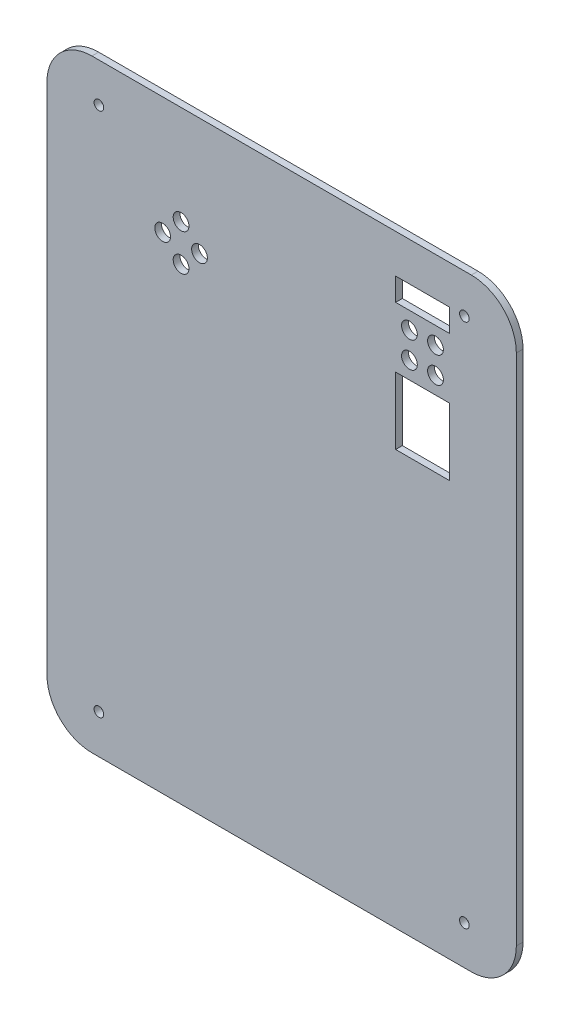
ISO-10303-21;
HEADER;
FILE_DESCRIPTION(('STEP AP214'),'2;1');
FILE_NAME('part.step','',(''),(''),'','','');
FILE_SCHEMA(('AUTOMOTIVE_DESIGN { 1 0 10303 214 1 1 1 1 }'));
ENDSEC;
DATA;
#1=APPLICATION_CONTEXT('core data for automotive mechanical design processes');
#2=APPLICATION_PROTOCOL_DEFINITION('international standard','automotive_design',2000,#1);
#3=PRODUCT_CONTEXT('',#1,'mechanical');
#4=PRODUCT('Part','Part','',(#3));
#5=PRODUCT_RELATED_PRODUCT_CATEGORY('part','',(#4));
#6=PRODUCT_DEFINITION_FORMATION('','',#4);
#7=PRODUCT_DEFINITION_CONTEXT('part definition',#1,'design');
#8=PRODUCT_DEFINITION('design','',#6,#7);
#9=PRODUCT_DEFINITION_SHAPE('','',#8);
#10=(LENGTH_UNIT() NAMED_UNIT(*) SI_UNIT(.MILLI.,.METRE.));
#11=(NAMED_UNIT(*) PLANE_ANGLE_UNIT() SI_UNIT($,.RADIAN.));
#12=(NAMED_UNIT(*) SI_UNIT($,.STERADIAN.) SOLID_ANGLE_UNIT());
#13=UNCERTAINTY_MEASURE_WITH_UNIT(LENGTH_MEASURE(1.E-05),#10,'distance_accuracy_value','');
#14=(GEOMETRIC_REPRESENTATION_CONTEXT(3) GLOBAL_UNCERTAINTY_ASSIGNED_CONTEXT((#13)) GLOBAL_UNIT_ASSIGNED_CONTEXT((#10,
#11,#12)) REPRESENTATION_CONTEXT('',''));
#15=CARTESIAN_POINT('',(0.,0.,0.));
#16=DIRECTION('',(0.,0.,1.));
#17=DIRECTION('',(1.,0.,0.));
#18=AXIS2_PLACEMENT_3D('',#15,#16,#17);
#19=CARTESIAN_POINT('',(-71.8566,-97.2566,0.));
#20=DIRECTION('',(0.,0.,-1.));
#21=DIRECTION('',(-1.,0.,0.));
#22=AXIS2_PLACEMENT_3D('',#19,#20,#21);
#23=PLANE('',#22);
#24=CARTESIAN_POINT('',(-71.8566,-97.2566,0.));
#25=DIRECTION('',(0.,0.,1.));
#26=DIRECTION('',(-1.,0.,0.));
#27=AXIS2_PLACEMENT_3D('',#24,#25,#26);
#28=CIRCLE('',#27,17.0434);
#29=CARTESIAN_POINT('',(-88.9,-97.2566,0.));
#30=VERTEX_POINT('',#29);
#31=CARTESIAN_POINT('',(-71.8566,-114.3,0.));
#32=VERTEX_POINT('',#31);
#33=EDGE_CURVE('E306',#30,#32,#28,.T.);
#34=ORIENTED_EDGE('',*,*,#33,.F.);
#35=DIRECTION('',(0.,-1.,0.));
#36=VECTOR('',#35,1.);
#37=CARTESIAN_POINT('',(-88.9,-97.2566,0.));
#38=LINE('',#37,#36);
#39=CARTESIAN_POINT('',(-88.9,97.2566,0.));
#40=VERTEX_POINT('',#39);
#41=EDGE_CURVE('E315',#40,#30,#38,.T.);
#42=ORIENTED_EDGE('',*,*,#41,.F.);
#43=CARTESIAN_POINT('',(-71.8566,97.2566,0.));
#44=DIRECTION('',(0.,0.,1.));
#45=DIRECTION('',(-1.,0.,0.));
#46=AXIS2_PLACEMENT_3D('',#43,#44,#45);
#47=CIRCLE('',#46,17.0434);
#48=CARTESIAN_POINT('',(-71.8566,114.3,0.));
#49=VERTEX_POINT('',#48);
#50=EDGE_CURVE('E355',#49,#40,#47,.T.);
#51=ORIENTED_EDGE('',*,*,#50,.F.);
#52=DIRECTION('',(-1.,0.,0.));
#53=VECTOR('',#52,1.);
#54=CARTESIAN_POINT('',(71.8566,114.3,0.));
#55=LINE('',#54,#53);
#56=CARTESIAN_POINT('',(71.8566,114.3,0.));
#57=VERTEX_POINT('',#56);
#58=EDGE_CURVE('E352',#57,#49,#55,.T.);
#59=ORIENTED_EDGE('',*,*,#58,.F.);
#60=CARTESIAN_POINT('',(71.8566,97.2566,0.));
#61=DIRECTION('',(0.,0.,1.));
#62=DIRECTION('',(1.,0.,0.));
#63=AXIS2_PLACEMENT_3D('',#60,#61,#62);
#64=CIRCLE('',#63,17.0434);
#65=CARTESIAN_POINT('',(88.9,97.2566,0.));
#66=VERTEX_POINT('',#65);
#67=EDGE_CURVE('E349',#66,#57,#64,.T.);
#68=ORIENTED_EDGE('',*,*,#67,.F.);
#69=DIRECTION('',(0.,1.,0.));
#70=VECTOR('',#69,1.);
#71=CARTESIAN_POINT('',(88.9,-97.2566,0.));
#72=LINE('',#71,#70);
#73=CARTESIAN_POINT('',(88.9,-97.2566,0.));
#74=VERTEX_POINT('',#73);
#75=EDGE_CURVE('E346',#74,#66,#72,.T.);
#76=ORIENTED_EDGE('',*,*,#75,.F.);
#77=CARTESIAN_POINT('',(71.8566,-97.2566,0.));
#78=DIRECTION('',(0.,0.,1.));
#79=DIRECTION('',(-1.,0.,0.));
#80=AXIS2_PLACEMENT_3D('',#77,#78,#79);
#81=CIRCLE('',#80,17.0434);
#82=CARTESIAN_POINT('',(71.8566,-114.3,0.));
#83=VERTEX_POINT('',#82);
#84=EDGE_CURVE('E343',#83,#74,#81,.T.);
#85=ORIENTED_EDGE('',*,*,#84,.F.);
#86=DIRECTION('',(1.,0.,0.));
#87=VECTOR('',#86,1.);
#88=CARTESIAN_POINT('',(71.8566,-114.3,0.));
#89=LINE('',#88,#87);
#90=EDGE_CURVE('E340',#32,#83,#89,.T.);
#91=ORIENTED_EDGE('',*,*,#90,.F.);
#92=EDGE_LOOP('',(#34,#42,#51,#59,#68,#76,#85,#91));
#93=FACE_BOUND('',#92,.T.);
#94=CARTESIAN_POINT('',(58.279140866588,84.504640866588,0.));
#95=DIRECTION('',(0.,0.,1.));
#96=DIRECTION('',(1.,0.,0.));
#97=AXIS2_PLACEMENT_3D('',#94,#95,#96);
#98=CIRCLE('',#97,2.9845);
#99=CARTESIAN_POINT('',(61.263640866588,84.504640866588,0.));
#100=VERTEX_POINT('',#99);
#101=EDGE_CURVE('E302',#100,#100,#98,.T.);
#102=ORIENTED_EDGE('',*,*,#101,.T.);
#103=EDGE_LOOP('',(#102));
#104=FACE_BOUND('',#103,.T.);
#105=DIRECTION('',(0.,-1.,0.));
#106=VECTOR('',#105,1.);
#107=CARTESIAN_POINT('',(43.18,42.7355,0.));
#108=LINE('',#107,#106);
#109=CARTESIAN_POINT('',(43.18,68.1355,0.));
#110=VERTEX_POINT('',#109);
#111=CARTESIAN_POINT('',(43.18,42.7355,0.));
#112=VERTEX_POINT('',#111);
#113=EDGE_CURVE('E161',#110,#112,#108,.T.);
#114=ORIENTED_EDGE('',*,*,#113,.T.);
#115=DIRECTION('',(1.,0.,0.));
#116=VECTOR('',#115,1.);
#117=CARTESIAN_POINT('',(63.5,42.7355,0.));
#118=LINE('',#117,#116);
#119=CARTESIAN_POINT('',(63.5,42.7355,0.));
#120=VERTEX_POINT('',#119);
#121=EDGE_CURVE('E201',#112,#120,#118,.T.);
#122=ORIENTED_EDGE('',*,*,#121,.T.);
#123=DIRECTION('',(0.,1.,0.));
#124=VECTOR('',#123,1.);
#125=CARTESIAN_POINT('',(63.5,68.1355,0.));
#126=LINE('',#125,#124);
#127=CARTESIAN_POINT('',(63.5,68.1355,0.));
#128=VERTEX_POINT('',#127);
#129=EDGE_CURVE('E196',#120,#128,#126,.T.);
#130=ORIENTED_EDGE('',*,*,#129,.T.);
#131=DIRECTION('',(-1.,0.,0.));
#132=VECTOR('',#131,1.);
#133=CARTESIAN_POINT('',(43.18,68.1355,0.));
#134=LINE('',#133,#132);
#135=EDGE_CURVE('E193',#128,#110,#134,.T.);
#136=ORIENTED_EDGE('',*,*,#135,.T.);
#137=EDGE_LOOP('',(#114,#122,#130,#136));
#138=FACE_BOUND('',#137,.T.);
#139=CARTESIAN_POINT('',(-38.1,76.835,0.));
#140=DIRECTION('',(0.,0.,1.));
#141=DIRECTION('',(1.,0.,0.));
#142=AXIS2_PLACEMENT_3D('',#139,#140,#141);
#143=CIRCLE('',#142,2.9845);
#144=CARTESIAN_POINT('',(-35.1155,76.835,0.));
#145=VERTEX_POINT('',#144);
#146=EDGE_CURVE('E258',#145,#145,#143,.T.);
#147=ORIENTED_EDGE('',*,*,#146,.T.);
#148=EDGE_LOOP('',(#147));
#149=FACE_BOUND('',#148,.T.);
#150=CARTESIAN_POINT('',(48.400859133412,84.504640866588,0.));
#151=DIRECTION('',(0.,0.,1.));
#152=DIRECTION('',(1.,0.,0.));
#153=AXIS2_PLACEMENT_3D('',#150,#151,#152);
#154=CIRCLE('',#153,2.9845);
#155=CARTESIAN_POINT('',(51.385359133412,84.504640866588,0.));
#156=VERTEX_POINT('',#155);
#157=EDGE_CURVE('E275',#156,#156,#154,.T.);
#158=ORIENTED_EDGE('',*,*,#157,.T.);
#159=EDGE_LOOP('',(#158));
#160=FACE_BOUND('',#159,.T.);
#161=CARTESIAN_POINT('',(48.400859133412,74.626359133412,0.));
#162=DIRECTION('',(0.,0.,1.));
#163=DIRECTION('',(1.,0.,0.));
#164=AXIS2_PLACEMENT_3D('',#161,#162,#163);
#165=CIRCLE('',#164,2.9845);
#166=CARTESIAN_POINT('',(51.385359133412,74.626359133412,0.));
#167=VERTEX_POINT('',#166);
#168=EDGE_CURVE('E274',#167,#167,#165,.T.);
#169=ORIENTED_EDGE('',*,*,#168,.T.);
#170=EDGE_LOOP('',(#169));
#171=FACE_BOUND('',#170,.T.);
#172=CARTESIAN_POINT('',(58.279140866588,74.626359133412,0.));
#173=DIRECTION('',(0.,0.,1.));
#174=DIRECTION('',(1.,0.,0.));
#175=AXIS2_PLACEMENT_3D('',#172,#173,#174);
#176=CIRCLE('',#175,2.9845);
#177=CARTESIAN_POINT('',(61.263640866588,74.626359133412,0.));
#178=VERTEX_POINT('',#177);
#179=EDGE_CURVE('E291',#178,#178,#176,.T.);
#180=ORIENTED_EDGE('',*,*,#179,.T.);
#181=EDGE_LOOP('',(#180));
#182=FACE_BOUND('',#181,.T.);
#183=DIRECTION('',(0.,-1.,0.));
#184=VECTOR('',#183,1.);
#185=CARTESIAN_POINT('',(43.18,99.6315,0.));
#186=LINE('',#185,#184);
#187=CARTESIAN_POINT('',(43.18,99.6315,0.));
#188=VERTEX_POINT('',#187);
#189=CARTESIAN_POINT('',(43.18,90.9955,0.));
#190=VERTEX_POINT('',#189);
#191=EDGE_CURVE('E230',#188,#190,#186,.T.);
#192=ORIENTED_EDGE('',*,*,#191,.T.);
#193=DIRECTION('',(1.,0.,0.));
#194=VECTOR('',#193,1.);
#195=CARTESIAN_POINT('',(43.18,90.9955,0.));
#196=LINE('',#195,#194);
#197=CARTESIAN_POINT('',(63.5,90.9955,0.));
#198=VERTEX_POINT('',#197);
#199=EDGE_CURVE('E247',#190,#198,#196,.T.);
#200=ORIENTED_EDGE('',*,*,#199,.T.);
#201=DIRECTION('',(0.,1.,0.));
#202=VECTOR('',#201,1.);
#203=CARTESIAN_POINT('',(63.5,90.9955,0.));
#204=LINE('',#203,#202);
#205=CARTESIAN_POINT('',(63.5,99.6315,0.));
#206=VERTEX_POINT('',#205);
#207=EDGE_CURVE('E243',#198,#206,#204,.T.);
#208=ORIENTED_EDGE('',*,*,#207,.T.);
#209=DIRECTION('',(-1.,0.,0.));
#210=VECTOR('',#209,1.);
#211=CARTESIAN_POINT('',(63.5,99.6315,0.));
#212=LINE('',#211,#210);
#213=EDGE_CURVE('E219',#206,#188,#212,.T.);
#214=ORIENTED_EDGE('',*,*,#213,.T.);
#215=EDGE_LOOP('',(#192,#200,#208,#214));
#216=FACE_BOUND('',#215,.T.);
#217=CARTESIAN_POINT('',(-45.085,69.85,0.));
#218=DIRECTION('',(0.,0.,1.));
#219=DIRECTION('',(1.,0.,0.));
#220=AXIS2_PLACEMENT_3D('',#217,#218,#219);
#221=CIRCLE('',#220,2.9845);
#222=CARTESIAN_POINT('',(-42.1005,69.85,0.));
#223=VERTEX_POINT('',#222);
#224=EDGE_CURVE('E212',#223,#223,#221,.T.);
#225=ORIENTED_EDGE('',*,*,#224,.T.);
#226=EDGE_LOOP('',(#225));
#227=FACE_BOUND('',#226,.T.);
#228=CARTESIAN_POINT('',(-38.1,62.865,0.));
#229=DIRECTION('',(0.,0.,1.));
#230=DIRECTION('',(1.,0.,0.));
#231=AXIS2_PLACEMENT_3D('',#228,#229,#230);
#232=CIRCLE('',#231,2.98450000000001);
#233=CARTESIAN_POINT('',(-35.1155,62.865,0.));
#234=VERTEX_POINT('',#233);
#235=EDGE_CURVE('E211',#234,#234,#232,.T.);
#236=ORIENTED_EDGE('',*,*,#235,.T.);
#237=EDGE_LOOP('',(#236));
#238=FACE_BOUND('',#237,.T.);
#239=CARTESIAN_POINT('',(-31.115,69.85,0.));
#240=DIRECTION('',(0.,0.,1.));
#241=DIRECTION('',(1.,0.,0.));
#242=AXIS2_PLACEMENT_3D('',#239,#240,#241);
#243=CIRCLE('',#242,2.9845);
#244=CARTESIAN_POINT('',(-28.1305,69.85,0.));
#245=VERTEX_POINT('',#244);
#246=EDGE_CURVE('E259',#245,#245,#243,.T.);
#247=ORIENTED_EDGE('',*,*,#246,.T.);
#248=EDGE_LOOP('',(#247));
#249=FACE_BOUND('',#248,.T.);
#250=CARTESIAN_POINT('',(69.219129999995,99.5086149999996,0.));
#251=DIRECTION('',(0.,0.,1.));
#252=DIRECTION('',(1.,0.,0.));
#253=AXIS2_PLACEMENT_3D('',#250,#251,#252);
#254=CIRCLE('',#253,1.82879999999999);
#255=CARTESIAN_POINT('',(71.047929999995,99.5086149999996,0.));
#256=VERTEX_POINT('',#255);
#257=EDGE_CURVE('E167',#256,#256,#254,.T.);
#258=ORIENTED_EDGE('',*,*,#257,.T.);
#259=EDGE_LOOP('',(#258));
#260=FACE_BOUND('',#259,.T.);
#261=CARTESIAN_POINT('',(-69.2191299999949,-99.5086149999996,0.));
#262=DIRECTION('',(0.,0.,1.));
#263=DIRECTION('',(1.,0.,0.));
#264=AXIS2_PLACEMENT_3D('',#261,#262,#263);
#265=CIRCLE('',#264,1.82879999999999);
#266=CARTESIAN_POINT('',(-67.390329999995,-99.5086149999996,0.));
#267=VERTEX_POINT('',#266);
#268=EDGE_CURVE('E549',#267,#267,#265,.T.);
#269=ORIENTED_EDGE('',*,*,#268,.T.);
#270=EDGE_LOOP('',(#269));
#271=FACE_BOUND('',#270,.T.);
#272=CARTESIAN_POINT('',(-69.21913,99.508615,0.));
#273=DIRECTION('',(0.,0.,1.));
#274=DIRECTION('',(1.,0.,0.));
#275=AXIS2_PLACEMENT_3D('',#272,#273,#274);
#276=CIRCLE('',#275,1.82879999999999);
#277=CARTESIAN_POINT('',(-67.39033,99.508615,0.));
#278=VERTEX_POINT('',#277);
#279=EDGE_CURVE('E541',#278,#278,#276,.T.);
#280=ORIENTED_EDGE('',*,*,#279,.T.);
#281=EDGE_LOOP('',(#280));
#282=FACE_BOUND('',#281,.T.);
#283=CARTESIAN_POINT('',(69.219129999995,-99.5086149999996,0.));
#284=DIRECTION('',(0.,0.,1.));
#285=DIRECTION('',(1.,0.,0.));
#286=AXIS2_PLACEMENT_3D('',#283,#284,#285);
#287=CIRCLE('',#286,1.82879999999999);
#288=CARTESIAN_POINT('',(71.047929999995,-99.5086149999996,0.));
#289=VERTEX_POINT('',#288);
#290=EDGE_CURVE('E528',#289,#289,#287,.T.);
#291=ORIENTED_EDGE('',*,*,#290,.T.);
#292=EDGE_LOOP('',(#291));
#293=FACE_BOUND('',#292,.T.);
#294=ADVANCED_FACE('F45',(#93,#104,#138,#149,#160,#171,#182,#216,#227,#238,#249,#260,#271,#282,
#293),#23,.T.);
#295=CARTESIAN_POINT('',(-71.8566,-97.2566,2.54));
#296=DIRECTION('',(0.,0.,-1.));
#297=DIRECTION('',(-1.,0.,0.));
#298=AXIS2_PLACEMENT_3D('',#295,#296,#297);
#299=PLANE('',#298);
#300=CARTESIAN_POINT('',(69.219129999995,-99.5086149999996,2.54));
#301=DIRECTION('',(0.,0.,1.));
#302=DIRECTION('',(1.,0.,0.));
#303=AXIS2_PLACEMENT_3D('',#300,#301,#302);
#304=CIRCLE('',#303,1.82879999999999);
#305=CARTESIAN_POINT('',(71.047929999995,-99.5086149999996,2.54));
#306=VERTEX_POINT('',#305);
#307=EDGE_CURVE('E531',#306,#306,#304,.T.);
#308=ORIENTED_EDGE('',*,*,#307,.F.);
#309=EDGE_LOOP('',(#308));
#310=FACE_BOUND('',#309,.T.);
#311=CARTESIAN_POINT('',(-69.21913,99.508615,2.54));
#312=DIRECTION('',(0.,0.,1.));
#313=DIRECTION('',(1.,0.,0.));
#314=AXIS2_PLACEMENT_3D('',#311,#312,#313);
#315=CIRCLE('',#314,1.82879999999999);
#316=CARTESIAN_POINT('',(-67.39033,99.508615,2.54));
#317=VERTEX_POINT('',#316);
#318=EDGE_CURVE('E535',#317,#317,#315,.T.);
#319=ORIENTED_EDGE('',*,*,#318,.F.);
#320=EDGE_LOOP('',(#319));
#321=FACE_BOUND('',#320,.T.);
#322=CARTESIAN_POINT('',(-69.2191299999949,-99.5086149999996,2.54));
#323=DIRECTION('',(0.,0.,1.));
#324=DIRECTION('',(1.,0.,0.));
#325=AXIS2_PLACEMENT_3D('',#322,#323,#324);
#326=CIRCLE('',#325,1.82879999999999);
#327=CARTESIAN_POINT('',(-67.390329999995,-99.5086149999996,2.54));
#328=VERTEX_POINT('',#327);
#329=EDGE_CURVE('E545',#328,#328,#326,.T.);
#330=ORIENTED_EDGE('',*,*,#329,.F.);
#331=EDGE_LOOP('',(#330));
#332=FACE_BOUND('',#331,.T.);
#333=CARTESIAN_POINT('',(-31.115,69.85,2.54));
#334=DIRECTION('',(0.,0.,1.));
#335=DIRECTION('',(1.,0.,0.));
#336=AXIS2_PLACEMENT_3D('',#333,#334,#335);
#337=CIRCLE('',#336,2.9845);
#338=CARTESIAN_POINT('',(-28.1305,69.85,2.54));
#339=VERTEX_POINT('',#338);
#340=EDGE_CURVE('E254',#339,#339,#337,.T.);
#341=ORIENTED_EDGE('',*,*,#340,.F.);
#342=EDGE_LOOP('',(#341));
#343=FACE_BOUND('',#342,.T.);
#344=CARTESIAN_POINT('',(-38.1,62.865,2.54));
#345=DIRECTION('',(0.,0.,1.));
#346=DIRECTION('',(1.,0.,0.));
#347=AXIS2_PLACEMENT_3D('',#344,#345,#346);
#348=CIRCLE('',#347,2.98450000000001);
#349=CARTESIAN_POINT('',(-35.1155,62.865,2.54));
#350=VERTEX_POINT('',#349);
#351=EDGE_CURVE('E263',#350,#350,#348,.T.);
#352=ORIENTED_EDGE('',*,*,#351,.F.);
#353=EDGE_LOOP('',(#352));
#354=FACE_BOUND('',#353,.T.);
#355=CARTESIAN_POINT('',(-45.085,69.85,2.54));
#356=DIRECTION('',(0.,0.,1.));
#357=DIRECTION('',(1.,0.,0.));
#358=AXIS2_PLACEMENT_3D('',#355,#356,#357);
#359=CIRCLE('',#358,2.9845);
#360=CARTESIAN_POINT('',(-42.1005,69.85,2.54));
#361=VERTEX_POINT('',#360);
#362=EDGE_CURVE('E207',#361,#361,#359,.T.);
#363=ORIENTED_EDGE('',*,*,#362,.F.);
#364=EDGE_LOOP('',(#363));
#365=FACE_BOUND('',#364,.T.);
#366=DIRECTION('',(1.,0.,0.));
#367=VECTOR('',#366,1.);
#368=CARTESIAN_POINT('',(43.18,90.9955,2.54));
#369=LINE('',#368,#367);
#370=CARTESIAN_POINT('',(43.18,90.9955,2.54));
#371=VERTEX_POINT('',#370);
#372=CARTESIAN_POINT('',(63.5,90.9955,2.54));
#373=VERTEX_POINT('',#372);
#374=EDGE_CURVE('E234',#371,#373,#369,.T.);
#375=ORIENTED_EDGE('',*,*,#374,.F.);
#376=DIRECTION('',(0.,-1.,0.));
#377=VECTOR('',#376,1.);
#378=CARTESIAN_POINT('',(43.18,99.6315,2.54));
#379=LINE('',#378,#377);
#380=CARTESIAN_POINT('',(43.18,99.6315,2.54));
#381=VERTEX_POINT('',#380);
#382=EDGE_CURVE('E61',#381,#371,#379,.T.);
#383=ORIENTED_EDGE('',*,*,#382,.F.);
#384=DIRECTION('',(-1.,0.,0.));
#385=VECTOR('',#384,1.);
#386=CARTESIAN_POINT('',(63.5,99.6315,2.54));
#387=LINE('',#386,#385);
#388=CARTESIAN_POINT('',(63.5,99.6315,2.54));
#389=VERTEX_POINT('',#388);
#390=EDGE_CURVE('E225',#389,#381,#387,.T.);
#391=ORIENTED_EDGE('',*,*,#390,.F.);
#392=DIRECTION('',(0.,1.,0.));
#393=VECTOR('',#392,1.);
#394=CARTESIAN_POINT('',(63.5,90.9955,2.54));
#395=LINE('',#394,#393);
#396=EDGE_CURVE('E229',#373,#389,#395,.T.);
#397=ORIENTED_EDGE('',*,*,#396,.F.);
#398=EDGE_LOOP('',(#375,#383,#391,#397));
#399=FACE_BOUND('',#398,.T.);
#400=CARTESIAN_POINT('',(58.279140866588,74.626359133412,2.54));
#401=DIRECTION('',(0.,0.,1.));
#402=DIRECTION('',(1.,0.,0.));
#403=AXIS2_PLACEMENT_3D('',#400,#401,#402);
#404=CIRCLE('',#403,2.9845);
#405=CARTESIAN_POINT('',(61.263640866588,74.626359133412,2.54));
#406=VERTEX_POINT('',#405);
#407=EDGE_CURVE('E286',#406,#406,#404,.T.);
#408=ORIENTED_EDGE('',*,*,#407,.F.);
#409=EDGE_LOOP('',(#408));
#410=FACE_BOUND('',#409,.T.);
#411=CARTESIAN_POINT('',(48.400859133412,74.626359133412,2.54));
#412=DIRECTION('',(0.,0.,1.));
#413=DIRECTION('',(1.,0.,0.));
#414=AXIS2_PLACEMENT_3D('',#411,#412,#413);
#415=CIRCLE('',#414,2.9845);
#416=CARTESIAN_POINT('',(51.385359133412,74.626359133412,2.54));
#417=VERTEX_POINT('',#416);
#418=EDGE_CURVE('E295',#417,#417,#415,.T.);
#419=ORIENTED_EDGE('',*,*,#418,.F.);
#420=EDGE_LOOP('',(#419));
#421=FACE_BOUND('',#420,.T.);
#422=CARTESIAN_POINT('',(48.400859133412,84.504640866588,2.54));
#423=DIRECTION('',(0.,0.,1.));
#424=DIRECTION('',(1.,0.,0.));
#425=AXIS2_PLACEMENT_3D('',#422,#423,#424);
#426=CIRCLE('',#425,2.9845);
#427=CARTESIAN_POINT('',(51.385359133412,84.504640866588,2.54));
#428=VERTEX_POINT('',#427);
#429=EDGE_CURVE('E270',#428,#428,#426,.T.);
#430=ORIENTED_EDGE('',*,*,#429,.F.);
#431=EDGE_LOOP('',(#430));
#432=FACE_BOUND('',#431,.T.);
#433=CARTESIAN_POINT('',(-38.1,76.835,2.54));
#434=DIRECTION('',(0.,0.,1.));
#435=DIRECTION('',(1.,0.,0.));
#436=AXIS2_PLACEMENT_3D('',#433,#434,#435);
#437=CIRCLE('',#436,2.9845);
#438=CARTESIAN_POINT('',(-35.1155,76.835,2.54));
#439=VERTEX_POINT('',#438);
#440=EDGE_CURVE('E279',#439,#439,#437,.T.);
#441=ORIENTED_EDGE('',*,*,#440,.F.);
#442=EDGE_LOOP('',(#441));
#443=FACE_BOUND('',#442,.T.);
#444=DIRECTION('',(1.,0.,0.));
#445=VECTOR('',#444,1.);
#446=CARTESIAN_POINT('',(63.5,42.7355,2.54));
#447=LINE('',#446,#445);
#448=CARTESIAN_POINT('',(43.18,42.7355,2.54));
#449=VERTEX_POINT('',#448);
#450=CARTESIAN_POINT('',(63.5,42.7355,2.54));
#451=VERTEX_POINT('',#450);
#452=EDGE_CURVE('E182',#449,#451,#447,.T.);
#453=ORIENTED_EDGE('',*,*,#452,.F.);
#454=DIRECTION('',(0.,-1.,0.));
#455=VECTOR('',#454,1.);
#456=CARTESIAN_POINT('',(43.18,42.7355,2.54));
#457=LINE('',#456,#455);
#458=CARTESIAN_POINT('',(43.18,68.1355,2.54));
#459=VERTEX_POINT('',#458);
#460=EDGE_CURVE('E69',#459,#449,#457,.T.);
#461=ORIENTED_EDGE('',*,*,#460,.F.);
#462=DIRECTION('',(-1.,0.,0.));
#463=VECTOR('',#462,1.);
#464=CARTESIAN_POINT('',(43.18,68.1355,2.54));
#465=LINE('',#464,#463);
#466=CARTESIAN_POINT('',(63.5,68.1355,2.54));
#467=VERTEX_POINT('',#466);
#468=EDGE_CURVE('E170',#467,#459,#465,.T.);
#469=ORIENTED_EDGE('',*,*,#468,.F.);
#470=DIRECTION('',(0.,1.,0.));
#471=VECTOR('',#470,1.);
#472=CARTESIAN_POINT('',(63.5,68.1355,2.54));
#473=LINE('',#472,#471);
#474=EDGE_CURVE('E176',#451,#467,#473,.T.);
#475=ORIENTED_EDGE('',*,*,#474,.F.);
#476=EDGE_LOOP('',(#453,#461,#469,#475));
#477=FACE_BOUND('',#476,.T.);
#478=CARTESIAN_POINT('',(58.279140866588,84.504640866588,2.54));
#479=DIRECTION('',(0.,0.,1.));
#480=DIRECTION('',(1.,0.,0.));
#481=AXIS2_PLACEMENT_3D('',#478,#479,#480);
#482=CIRCLE('',#481,2.9845);
#483=CARTESIAN_POINT('',(61.263640866588,84.504640866588,2.54));
#484=VERTEX_POINT('',#483);
#485=EDGE_CURVE('E290',#484,#484,#482,.T.);
#486=ORIENTED_EDGE('',*,*,#485,.F.);
#487=EDGE_LOOP('',(#486));
#488=FACE_BOUND('',#487,.T.);
#489=CARTESIAN_POINT('',(-71.8566,-97.2566,2.54));
#490=DIRECTION('',(0.,0.,1.));
#491=DIRECTION('',(-1.,0.,0.));
#492=AXIS2_PLACEMENT_3D('',#489,#490,#491);
#493=CIRCLE('',#492,17.0434);
#494=CARTESIAN_POINT('',(-88.9,-97.2566,2.54));
#495=VERTEX_POINT('',#494);
#496=CARTESIAN_POINT('',(-71.8566,-114.3,2.54));
#497=VERTEX_POINT('',#496);
#498=EDGE_CURVE('E310',#495,#497,#493,.T.);
#499=ORIENTED_EDGE('',*,*,#498,.T.);
#500=DIRECTION('',(1.,0.,0.));
#501=VECTOR('',#500,1.);
#502=CARTESIAN_POINT('',(71.8566,-114.3,2.54));
#503=LINE('',#502,#501);
#504=CARTESIAN_POINT('',(71.8566,-114.3,2.54));
#505=VERTEX_POINT('',#504);
#506=EDGE_CURVE('E314',#497,#505,#503,.T.);
#507=ORIENTED_EDGE('',*,*,#506,.T.);
#508=CARTESIAN_POINT('',(71.8566,-97.2566,2.54));
#509=DIRECTION('',(0.,0.,1.));
#510=DIRECTION('',(-1.,0.,0.));
#511=AXIS2_PLACEMENT_3D('',#508,#509,#510);
#512=CIRCLE('',#511,17.0434);
#513=CARTESIAN_POINT('',(88.9,-97.2566,2.54));
#514=VERTEX_POINT('',#513);
#515=EDGE_CURVE('E318',#505,#514,#512,.T.);
#516=ORIENTED_EDGE('',*,*,#515,.T.);
#517=DIRECTION('',(0.,1.,0.));
#518=VECTOR('',#517,1.);
#519=CARTESIAN_POINT('',(88.9,-97.2566,2.54));
#520=LINE('',#519,#518);
#521=CARTESIAN_POINT('',(88.9,97.2566,2.54));
#522=VERTEX_POINT('',#521);
#523=EDGE_CURVE('E321',#514,#522,#520,.T.);
#524=ORIENTED_EDGE('',*,*,#523,.T.);
#525=CARTESIAN_POINT('',(71.8566,97.2566,2.54));
#526=DIRECTION('',(0.,0.,1.));
#527=DIRECTION('',(1.,0.,0.));
#528=AXIS2_PLACEMENT_3D('',#525,#526,#527);
#529=CIRCLE('',#528,17.0434);
#530=CARTESIAN_POINT('',(71.8566,114.3,2.54));
#531=VERTEX_POINT('',#530);
#532=EDGE_CURVE('E324',#522,#531,#529,.T.);
#533=ORIENTED_EDGE('',*,*,#532,.T.);
#534=DIRECTION('',(-1.,0.,0.));
#535=VECTOR('',#534,1.);
#536=CARTESIAN_POINT('',(71.8566,114.3,2.54));
#537=LINE('',#536,#535);
#538=CARTESIAN_POINT('',(-71.8566,114.3,2.54));
#539=VERTEX_POINT('',#538);
#540=EDGE_CURVE('E327',#531,#539,#537,.T.);
#541=ORIENTED_EDGE('',*,*,#540,.T.);
#542=CARTESIAN_POINT('',(-71.8566,97.2566,2.54));
#543=DIRECTION('',(0.,0.,1.));
#544=DIRECTION('',(-1.,0.,0.));
#545=AXIS2_PLACEMENT_3D('',#542,#543,#544);
#546=CIRCLE('',#545,17.0434);
#547=CARTESIAN_POINT('',(-88.9,97.2566,2.54));
#548=VERTEX_POINT('',#547);
#549=EDGE_CURVE('E330',#539,#548,#546,.T.);
#550=ORIENTED_EDGE('',*,*,#549,.T.);
#551=DIRECTION('',(0.,-1.,0.));
#552=VECTOR('',#551,1.);
#553=CARTESIAN_POINT('',(-88.9,-97.2566,2.54));
#554=LINE('',#553,#552);
#555=EDGE_CURVE('E333',#548,#495,#554,.T.);
#556=ORIENTED_EDGE('',*,*,#555,.T.);
#557=EDGE_LOOP('',(#499,#507,#516,#524,#533,#541,#550,#556));
#558=FACE_BOUND('',#557,.T.);
#559=CARTESIAN_POINT('',(69.219129999995,99.5086149999996,2.54));
#560=DIRECTION('',(0.,0.,1.));
#561=DIRECTION('',(1.,0.,0.));
#562=AXIS2_PLACEMENT_3D('',#559,#560,#561);
#563=CIRCLE('',#562,1.82879999999999);
#564=CARTESIAN_POINT('',(71.047929999995,99.5086149999996,2.54));
#565=VERTEX_POINT('',#564);
#566=EDGE_CURVE('E553',#565,#565,#563,.T.);
#567=ORIENTED_EDGE('',*,*,#566,.F.);
#568=EDGE_LOOP('',(#567));
#569=FACE_BOUND('',#568,.T.);
#570=ADVANCED_FACE('F179',(#310,#321,#332,#343,#354,#365,#399,#410,#421,#432,#443,#477,#488,
#558,#569),#299,.F.);
#571=CARTESIAN_POINT('',(-71.8566,-97.2566,2.54));
#572=DIRECTION('',(0.,0.,-1.));
#573=DIRECTION('',(-1.,0.,0.));
#574=AXIS2_PLACEMENT_3D('',#571,#572,#573);
#575=CYLINDRICAL_SURFACE('',#574,17.0434);
#576=ORIENTED_EDGE('',*,*,#33,.T.);
#577=DIRECTION('',(0.,0.,-1.));
#578=VECTOR('',#577,1.);
#579=CARTESIAN_POINT('',(-71.8566,-114.3,2.54));
#580=LINE('',#579,#578);
#581=EDGE_CURVE('E11',#497,#32,#580,.T.);
#582=ORIENTED_EDGE('',*,*,#581,.F.);
#583=ORIENTED_EDGE('',*,*,#498,.F.);
#584=DIRECTION('',(0.,0.,-1.));
#585=VECTOR('',#584,1.);
#586=CARTESIAN_POINT('',(-88.9,-97.2566,2.54));
#587=LINE('',#586,#585);
#588=EDGE_CURVE('E336',#495,#30,#587,.T.);
#589=ORIENTED_EDGE('',*,*,#588,.T.);
#590=EDGE_LOOP('',(#576,#582,#583,#589));
#591=FACE_BOUND('',#590,.T.);
#592=ADVANCED_FACE('F47',(#591),#575,.T.);
#593=CARTESIAN_POINT('',(71.8566,-114.3,2.54));
#594=DIRECTION('',(0.,1.,0.));
#595=DIRECTION('',(0.,0.,1.));
#596=AXIS2_PLACEMENT_3D('',#593,#594,#595);
#597=PLANE('',#596);
#598=ORIENTED_EDGE('',*,*,#90,.T.);
#599=DIRECTION('',(0.,0.,-1.));
#600=VECTOR('',#599,1.);
#601=CARTESIAN_POINT('',(71.8566,-114.3,2.54));
#602=LINE('',#601,#600);
#603=EDGE_CURVE('E54',#505,#83,#602,.T.);
#604=ORIENTED_EDGE('',*,*,#603,.F.);
#605=ORIENTED_EDGE('',*,*,#506,.F.);
#606=ORIENTED_EDGE('',*,*,#581,.T.);
#607=EDGE_LOOP('',(#598,#604,#605,#606));
#608=FACE_BOUND('',#607,.T.);
#609=ADVANCED_FACE('F411',(#608),#597,.F.);
#610=CARTESIAN_POINT('',(71.8566,-97.2566,2.54));
#611=DIRECTION('',(0.,0.,-1.));
#612=DIRECTION('',(-1.,0.,0.));
#613=AXIS2_PLACEMENT_3D('',#610,#611,#612);
#614=CYLINDRICAL_SURFACE('',#613,17.0434);
#615=ORIENTED_EDGE('',*,*,#84,.T.);
#616=DIRECTION('',(0.,0.,-1.));
#617=VECTOR('',#616,1.);
#618=CARTESIAN_POINT('',(88.9,-97.2566,2.54));
#619=LINE('',#618,#617);
#620=EDGE_CURVE('E379',#514,#74,#619,.T.);
#621=ORIENTED_EDGE('',*,*,#620,.F.);
#622=ORIENTED_EDGE('',*,*,#515,.F.);
#623=ORIENTED_EDGE('',*,*,#603,.T.);
#624=EDGE_LOOP('',(#615,#621,#622,#623));
#625=FACE_BOUND('',#624,.T.);
#626=ADVANCED_FACE('F388',(#625),#614,.T.);
#627=CARTESIAN_POINT('',(88.9,-97.2566,2.54));
#628=DIRECTION('',(-1.,0.,0.));
#629=DIRECTION('',(0.,0.,1.));
#630=AXIS2_PLACEMENT_3D('',#627,#628,#629);
#631=PLANE('',#630);
#632=ORIENTED_EDGE('',*,*,#75,.T.);
#633=DIRECTION('',(0.,0.,-1.));
#634=VECTOR('',#633,1.);
#635=CARTESIAN_POINT('',(88.9,97.2566,2.54));
#636=LINE('',#635,#634);
#637=EDGE_CURVE('E375',#522,#66,#636,.T.);
#638=ORIENTED_EDGE('',*,*,#637,.F.);
#639=ORIENTED_EDGE('',*,*,#523,.F.);
#640=ORIENTED_EDGE('',*,*,#620,.T.);
#641=EDGE_LOOP('',(#632,#638,#639,#640));
#642=FACE_BOUND('',#641,.T.);
#643=ADVANCED_FACE('F399',(#642),#631,.F.);
#644=CARTESIAN_POINT('',(71.8566,97.2566,2.54));
#645=DIRECTION('',(0.,0.,-1.));
#646=DIRECTION('',(-1.,0.,0.));
#647=AXIS2_PLACEMENT_3D('',#644,#645,#646);
#648=CYLINDRICAL_SURFACE('',#647,17.0434);
#649=ORIENTED_EDGE('',*,*,#67,.T.);
#650=DIRECTION('',(0.,0.,-1.));
#651=VECTOR('',#650,1.);
#652=CARTESIAN_POINT('',(71.8566,114.3,2.54));
#653=LINE('',#652,#651);
#654=EDGE_CURVE('E371',#531,#57,#653,.T.);
#655=ORIENTED_EDGE('',*,*,#654,.F.);
#656=ORIENTED_EDGE('',*,*,#532,.F.);
#657=ORIENTED_EDGE('',*,*,#637,.T.);
#658=EDGE_LOOP('',(#649,#655,#656,#657));
#659=FACE_BOUND('',#658,.T.);
#660=ADVANCED_FACE('F403',(#659),#648,.T.);
#661=CARTESIAN_POINT('',(71.8566,114.3,2.54));
#662=DIRECTION('',(0.,-1.,0.));
#663=DIRECTION('',(0.,0.,-1.));
#664=AXIS2_PLACEMENT_3D('',#661,#662,#663);
#665=PLANE('',#664);
#666=ORIENTED_EDGE('',*,*,#58,.T.);
#667=DIRECTION('',(0.,0.,-1.));
#668=VECTOR('',#667,1.);
#669=CARTESIAN_POINT('',(-71.8566,114.3,2.54));
#670=LINE('',#669,#668);
#671=EDGE_CURVE('E367',#539,#49,#670,.T.);
#672=ORIENTED_EDGE('',*,*,#671,.F.);
#673=ORIENTED_EDGE('',*,*,#540,.F.);
#674=ORIENTED_EDGE('',*,*,#654,.T.);
#675=EDGE_LOOP('',(#666,#672,#673,#674));
#676=FACE_BOUND('',#675,.T.);
#677=ADVANCED_FACE('F424',(#676),#665,.F.);
#678=CARTESIAN_POINT('',(-71.8566,97.2566,2.54));
#679=DIRECTION('',(0.,0.,-1.));
#680=DIRECTION('',(-1.,0.,0.));
#681=AXIS2_PLACEMENT_3D('',#678,#679,#680);
#682=CYLINDRICAL_SURFACE('',#681,17.0434);
#683=ORIENTED_EDGE('',*,*,#50,.T.);
#684=DIRECTION('',(0.,0.,-1.));
#685=VECTOR('',#684,1.);
#686=CARTESIAN_POINT('',(-88.9,97.2566,2.54));
#687=LINE('',#686,#685);
#688=EDGE_CURVE('E363',#548,#40,#687,.T.);
#689=ORIENTED_EDGE('',*,*,#688,.F.);
#690=ORIENTED_EDGE('',*,*,#549,.F.);
#691=ORIENTED_EDGE('',*,*,#671,.T.);
#692=EDGE_LOOP('',(#683,#689,#690,#691));
#693=FACE_BOUND('',#692,.T.);
#694=ADVANCED_FACE('F422',(#693),#682,.T.);
#695=CARTESIAN_POINT('',(-88.9,-97.2566,2.54));
#696=DIRECTION('',(1.,0.,0.));
#697=DIRECTION('',(0.,0.,-1.));
#698=AXIS2_PLACEMENT_3D('',#695,#696,#697);
#699=PLANE('',#698);
#700=ORIENTED_EDGE('',*,*,#41,.T.);
#701=ORIENTED_EDGE('',*,*,#588,.F.);
#702=ORIENTED_EDGE('',*,*,#555,.F.);
#703=ORIENTED_EDGE('',*,*,#688,.T.);
#704=EDGE_LOOP('',(#700,#701,#702,#703));
#705=FACE_BOUND('',#704,.T.);
#706=ADVANCED_FACE('F417',(#705),#699,.F.);
#707=CARTESIAN_POINT('',(58.279140866588,84.504640866588,0.));
#708=DIRECTION('',(0.,0.,1.));
#709=DIRECTION('',(1.,0.,0.));
#710=AXIS2_PLACEMENT_3D('',#707,#708,#709);
#711=CYLINDRICAL_SURFACE('',#710,2.9845);
#712=ORIENTED_EDGE('',*,*,#101,.F.);
#713=EDGE_LOOP('',(#712));
#714=FACE_BOUND('',#713,.T.);
#715=ORIENTED_EDGE('',*,*,#485,.T.);
#716=EDGE_LOOP('',(#715));
#717=FACE_BOUND('',#716,.T.);
#718=ADVANCED_FACE('F444',(#714,#717),#711,.F.);
#719=CARTESIAN_POINT('',(43.18,42.7355,0.));
#720=DIRECTION('',(-1.,0.,0.));
#721=DIRECTION('',(0.,-1.,0.));
#722=AXIS2_PLACEMENT_3D('',#719,#720,#721);
#723=PLANE('',#722);
#724=ORIENTED_EDGE('',*,*,#460,.T.);
#725=DIRECTION('',(0.,0.,1.));
#726=VECTOR('',#725,1.);
#727=CARTESIAN_POINT('',(43.18,42.7355,0.));
#728=LINE('',#727,#726);
#729=EDGE_CURVE('E197',#112,#449,#728,.T.);
#730=ORIENTED_EDGE('',*,*,#729,.F.);
#731=ORIENTED_EDGE('',*,*,#113,.F.);
#732=DIRECTION('',(0.,0.,1.));
#733=VECTOR('',#732,1.);
#734=CARTESIAN_POINT('',(43.18,68.1355,0.));
#735=LINE('',#734,#733);
#736=EDGE_CURVE('E157',#110,#459,#735,.T.);
#737=ORIENTED_EDGE('',*,*,#736,.T.);
#738=EDGE_LOOP('',(#724,#730,#731,#737));
#739=FACE_BOUND('',#738,.T.);
#740=ADVANCED_FACE('F159',(#739),#723,.F.);
#741=CARTESIAN_POINT('',(43.18,68.1355,0.));
#742=DIRECTION('',(0.,1.,0.));
#743=DIRECTION('',(0.,0.,1.));
#744=AXIS2_PLACEMENT_3D('',#741,#742,#743);
#745=PLANE('',#744);
#746=ORIENTED_EDGE('',*,*,#468,.T.);
#747=ORIENTED_EDGE('',*,*,#736,.F.);
#748=ORIENTED_EDGE('',*,*,#135,.F.);
#749=DIRECTION('',(0.,0.,1.));
#750=VECTOR('',#749,1.);
#751=CARTESIAN_POINT('',(63.5,68.1355,0.));
#752=LINE('',#751,#750);
#753=EDGE_CURVE('E166',#128,#467,#752,.T.);
#754=ORIENTED_EDGE('',*,*,#753,.T.);
#755=EDGE_LOOP('',(#746,#747,#748,#754));
#756=FACE_BOUND('',#755,.T.);
#757=ADVANCED_FACE('F171',(#756),#745,.F.);
#758=CARTESIAN_POINT('',(63.5,68.1355,0.));
#759=DIRECTION('',(1.,0.,0.));
#760=DIRECTION('',(0.,0.,-1.));
#761=AXIS2_PLACEMENT_3D('',#758,#759,#760);
#762=PLANE('',#761);
#763=ORIENTED_EDGE('',*,*,#474,.T.);
#764=ORIENTED_EDGE('',*,*,#753,.F.);
#765=ORIENTED_EDGE('',*,*,#129,.F.);
#766=DIRECTION('',(0.,0.,1.));
#767=VECTOR('',#766,1.);
#768=CARTESIAN_POINT('',(63.5,42.7355,0.));
#769=LINE('',#768,#767);
#770=EDGE_CURVE('E562',#120,#451,#769,.T.);
#771=ORIENTED_EDGE('',*,*,#770,.T.);
#772=EDGE_LOOP('',(#763,#764,#765,#771));
#773=FACE_BOUND('',#772,.T.);
#774=ADVANCED_FACE('F502',(#773),#762,.F.);
#775=CARTESIAN_POINT('',(63.5,42.7355,0.));
#776=DIRECTION('',(0.,-1.,0.));
#777=DIRECTION('',(0.,0.,-1.));
#778=AXIS2_PLACEMENT_3D('',#775,#776,#777);
#779=PLANE('',#778);
#780=ORIENTED_EDGE('',*,*,#452,.T.);
#781=ORIENTED_EDGE('',*,*,#770,.F.);
#782=ORIENTED_EDGE('',*,*,#121,.F.);
#783=ORIENTED_EDGE('',*,*,#729,.T.);
#784=EDGE_LOOP('',(#780,#781,#782,#783));
#785=FACE_BOUND('',#784,.T.);
#786=ADVANCED_FACE('F469',(#785),#779,.F.);
#787=CARTESIAN_POINT('',(-38.1,76.835,0.));
#788=DIRECTION('',(0.,0.,1.));
#789=DIRECTION('',(1.,0.,0.));
#790=AXIS2_PLACEMENT_3D('',#787,#788,#789);
#791=CYLINDRICAL_SURFACE('',#790,2.9845);
#792=ORIENTED_EDGE('',*,*,#146,.F.);
#793=EDGE_LOOP('',(#792));
#794=FACE_BOUND('',#793,.T.);
#795=ORIENTED_EDGE('',*,*,#440,.T.);
#796=EDGE_LOOP('',(#795));
#797=FACE_BOUND('',#796,.T.);
#798=ADVANCED_FACE('F466',(#794,#797),#791,.F.);
#799=CARTESIAN_POINT('',(48.400859133412,84.504640866588,0.));
#800=DIRECTION('',(0.,0.,1.));
#801=DIRECTION('',(1.,0.,0.));
#802=AXIS2_PLACEMENT_3D('',#799,#800,#801);
#803=CYLINDRICAL_SURFACE('',#802,2.9845);
#804=ORIENTED_EDGE('',*,*,#157,.F.);
#805=EDGE_LOOP('',(#804));
#806=FACE_BOUND('',#805,.T.);
#807=ORIENTED_EDGE('',*,*,#429,.T.);
#808=EDGE_LOOP('',(#807));
#809=FACE_BOUND('',#808,.T.);
#810=ADVANCED_FACE('F460',(#806,#809),#803,.F.);
#811=CARTESIAN_POINT('',(48.400859133412,74.626359133412,0.));
#812=DIRECTION('',(0.,0.,1.));
#813=DIRECTION('',(1.,0.,0.));
#814=AXIS2_PLACEMENT_3D('',#811,#812,#813);
#815=CYLINDRICAL_SURFACE('',#814,2.9845);
#816=ORIENTED_EDGE('',*,*,#168,.F.);
#817=EDGE_LOOP('',(#816));
#818=FACE_BOUND('',#817,.T.);
#819=ORIENTED_EDGE('',*,*,#418,.T.);
#820=EDGE_LOOP('',(#819));
#821=FACE_BOUND('',#820,.T.);
#822=ADVANCED_FACE('F456',(#818,#821),#815,.F.);
#823=CARTESIAN_POINT('',(58.279140866588,74.626359133412,0.));
#824=DIRECTION('',(0.,0.,1.));
#825=DIRECTION('',(1.,0.,0.));
#826=AXIS2_PLACEMENT_3D('',#823,#824,#825);
#827=CYLINDRICAL_SURFACE('',#826,2.9845);
#828=ORIENTED_EDGE('',*,*,#179,.F.);
#829=EDGE_LOOP('',(#828));
#830=FACE_BOUND('',#829,.T.);
#831=ORIENTED_EDGE('',*,*,#407,.T.);
#832=EDGE_LOOP('',(#831));
#833=FACE_BOUND('',#832,.T.);
#834=ADVANCED_FACE('F459',(#830,#833),#827,.F.);
#835=CARTESIAN_POINT('',(43.18,99.6315,0.));
#836=DIRECTION('',(-1.,0.,0.));
#837=DIRECTION('',(0.,0.,1.));
#838=AXIS2_PLACEMENT_3D('',#835,#836,#837);
#839=PLANE('',#838);
#840=ORIENTED_EDGE('',*,*,#382,.T.);
#841=DIRECTION('',(0.,0.,1.));
#842=VECTOR('',#841,1.);
#843=CARTESIAN_POINT('',(43.18,90.9955,0.));
#844=LINE('',#843,#842);
#845=EDGE_CURVE('E216',#190,#371,#844,.T.);
#846=ORIENTED_EDGE('',*,*,#845,.F.);
#847=ORIENTED_EDGE('',*,*,#191,.F.);
#848=DIRECTION('',(0.,0.,1.));
#849=VECTOR('',#848,1.);
#850=CARTESIAN_POINT('',(43.18,99.6315,0.));
#851=LINE('',#850,#849);
#852=EDGE_CURVE('E184',#188,#381,#851,.T.);
#853=ORIENTED_EDGE('',*,*,#852,.T.);
#854=EDGE_LOOP('',(#840,#846,#847,#853));
#855=FACE_BOUND('',#854,.T.);
#856=ADVANCED_FACE('F464',(#855),#839,.F.);
#857=CARTESIAN_POINT('',(63.5,99.6315,0.));
#858=DIRECTION('',(0.,1.,0.));
#859=DIRECTION('',(0.,0.,1.));
#860=AXIS2_PLACEMENT_3D('',#857,#858,#859);
#861=PLANE('',#860);
#862=ORIENTED_EDGE('',*,*,#390,.T.);
#863=ORIENTED_EDGE('',*,*,#852,.F.);
#864=ORIENTED_EDGE('',*,*,#213,.F.);
#865=DIRECTION('',(0.,0.,1.));
#866=VECTOR('',#865,1.);
#867=CARTESIAN_POINT('',(63.5,99.6315,0.));
#868=LINE('',#867,#866);
#869=EDGE_CURVE('E188',#206,#389,#868,.T.);
#870=ORIENTED_EDGE('',*,*,#869,.T.);
#871=EDGE_LOOP('',(#862,#863,#864,#870));
#872=FACE_BOUND('',#871,.T.);
#873=ADVANCED_FACE('F483',(#872),#861,.F.);
#874=CARTESIAN_POINT('',(63.5,90.9955,0.));
#875=DIRECTION('',(1.,0.,0.));
#876=DIRECTION('',(0.,0.,-1.));
#877=AXIS2_PLACEMENT_3D('',#874,#875,#876);
#878=PLANE('',#877);
#879=ORIENTED_EDGE('',*,*,#396,.T.);
#880=ORIENTED_EDGE('',*,*,#869,.F.);
#881=ORIENTED_EDGE('',*,*,#207,.F.);
#882=DIRECTION('',(0.,0.,1.));
#883=VECTOR('',#882,1.);
#884=CARTESIAN_POINT('',(63.5,90.9955,0.));
#885=LINE('',#884,#883);
#886=EDGE_CURVE('E220',#198,#373,#885,.T.);
#887=ORIENTED_EDGE('',*,*,#886,.T.);
#888=EDGE_LOOP('',(#879,#880,#881,#887));
#889=FACE_BOUND('',#888,.T.);
#890=ADVANCED_FACE('F486',(#889),#878,.F.);
#891=CARTESIAN_POINT('',(43.18,90.9955,0.));
#892=DIRECTION('',(0.,-1.,0.));
#893=DIRECTION('',(0.,0.,-1.));
#894=AXIS2_PLACEMENT_3D('',#891,#892,#893);
#895=PLANE('',#894);
#896=ORIENTED_EDGE('',*,*,#374,.T.);
#897=ORIENTED_EDGE('',*,*,#886,.F.);
#898=ORIENTED_EDGE('',*,*,#199,.F.);
#899=ORIENTED_EDGE('',*,*,#845,.T.);
#900=EDGE_LOOP('',(#896,#897,#898,#899));
#901=FACE_BOUND('',#900,.T.);
#902=ADVANCED_FACE('F490',(#901),#895,.F.);
#903=CARTESIAN_POINT('',(-45.085,69.85,0.));
#904=DIRECTION('',(0.,0.,1.));
#905=DIRECTION('',(1.,0.,0.));
#906=AXIS2_PLACEMENT_3D('',#903,#904,#905);
#907=CYLINDRICAL_SURFACE('',#906,2.9845);
#908=ORIENTED_EDGE('',*,*,#224,.F.);
#909=EDGE_LOOP('',(#908));
#910=FACE_BOUND('',#909,.T.);
#911=ORIENTED_EDGE('',*,*,#362,.T.);
#912=EDGE_LOOP('',(#911));
#913=FACE_BOUND('',#912,.T.);
#914=ADVANCED_FACE('F478',(#910,#913),#907,.F.);
#915=CARTESIAN_POINT('',(-38.1,62.865,0.));
#916=DIRECTION('',(0.,0.,1.));
#917=DIRECTION('',(1.,0.,0.));
#918=AXIS2_PLACEMENT_3D('',#915,#916,#917);
#919=CYLINDRICAL_SURFACE('',#918,2.98450000000001);
#920=ORIENTED_EDGE('',*,*,#235,.F.);
#921=EDGE_LOOP('',(#920));
#922=FACE_BOUND('',#921,.T.);
#923=ORIENTED_EDGE('',*,*,#351,.T.);
#924=EDGE_LOOP('',(#923));
#925=FACE_BOUND('',#924,.T.);
#926=ADVANCED_FACE('F474',(#922,#925),#919,.F.);
#927=CARTESIAN_POINT('',(-31.115,69.85,0.));
#928=DIRECTION('',(0.,0.,1.));
#929=DIRECTION('',(1.,0.,0.));
#930=AXIS2_PLACEMENT_3D('',#927,#928,#929);
#931=CYLINDRICAL_SURFACE('',#930,2.9845);
#932=ORIENTED_EDGE('',*,*,#246,.F.);
#933=EDGE_LOOP('',(#932));
#934=FACE_BOUND('',#933,.T.);
#935=ORIENTED_EDGE('',*,*,#340,.T.);
#936=EDGE_LOOP('',(#935));
#937=FACE_BOUND('',#936,.T.);
#938=ADVANCED_FACE('F477',(#934,#937),#931,.F.);
#939=CARTESIAN_POINT('',(69.219129999995,99.5086149999996,2.54));
#940=DIRECTION('',(0.,0.,1.));
#941=DIRECTION('',(1.,0.,0.));
#942=AXIS2_PLACEMENT_3D('',#939,#940,#941);
#943=CYLINDRICAL_SURFACE('',#942,1.82879999999999);
#944=ORIENTED_EDGE('',*,*,#257,.F.);
#945=EDGE_LOOP('',(#944));
#946=FACE_BOUND('',#945,.T.);
#947=ORIENTED_EDGE('',*,*,#566,.T.);
#948=EDGE_LOOP('',(#947));
#949=FACE_BOUND('',#948,.T.);
#950=ADVANCED_FACE('F481',(#946,#949),#943,.F.);
#951=CARTESIAN_POINT('',(-69.2191299999949,-99.5086149999996,2.54));
#952=DIRECTION('',(0.,0.,1.));
#953=DIRECTION('',(1.,0.,0.));
#954=AXIS2_PLACEMENT_3D('',#951,#952,#953);
#955=CYLINDRICAL_SURFACE('',#954,1.82879999999999);
#956=ORIENTED_EDGE('',*,*,#268,.F.);
#957=EDGE_LOOP('',(#956));
#958=FACE_BOUND('',#957,.T.);
#959=ORIENTED_EDGE('',*,*,#329,.T.);
#960=EDGE_LOOP('',(#959));
#961=FACE_BOUND('',#960,.T.);
#962=ADVANCED_FACE('F511',(#958,#961),#955,.F.);
#963=CARTESIAN_POINT('',(-69.21913,99.508615,2.54));
#964=DIRECTION('',(0.,0.,1.));
#965=DIRECTION('',(1.,0.,0.));
#966=AXIS2_PLACEMENT_3D('',#963,#964,#965);
#967=CYLINDRICAL_SURFACE('',#966,1.82879999999999);
#968=ORIENTED_EDGE('',*,*,#279,.F.);
#969=EDGE_LOOP('',(#968));
#970=FACE_BOUND('',#969,.T.);
#971=ORIENTED_EDGE('',*,*,#318,.T.);
#972=EDGE_LOOP('',(#971));
#973=FACE_BOUND('',#972,.T.);
#974=ADVANCED_FACE('F515',(#970,#973),#967,.F.);
#975=CARTESIAN_POINT('',(69.219129999995,-99.5086149999996,2.54));
#976=DIRECTION('',(0.,0.,1.));
#977=DIRECTION('',(1.,0.,0.));
#978=AXIS2_PLACEMENT_3D('',#975,#976,#977);
#979=CYLINDRICAL_SURFACE('',#978,1.82879999999999);
#980=ORIENTED_EDGE('',*,*,#290,.F.);
#981=EDGE_LOOP('',(#980));
#982=FACE_BOUND('',#981,.T.);
#983=ORIENTED_EDGE('',*,*,#307,.T.);
#984=EDGE_LOOP('',(#983));
#985=FACE_BOUND('',#984,.T.);
#986=ADVANCED_FACE('F519',(#982,#985),#979,.F.);
#987=CLOSED_SHELL('',(#294,#570,#592,#609,#626,#643,#660,#677,#694,#706,#718,#740,#757,#774,
#786,#798,#810,#822,#834,#856,#873,#890,#902,#914,#926,#938,#950,#962,#974,#986));
#988=MANIFOLD_SOLID_BREP('B2',#987);
#989=ADVANCED_BREP_SHAPE_REPRESENTATION('',(#18,#988),#14);
#990=SHAPE_DEFINITION_REPRESENTATION(#9,#989);
ENDSEC;
END-ISO-10303-21;
